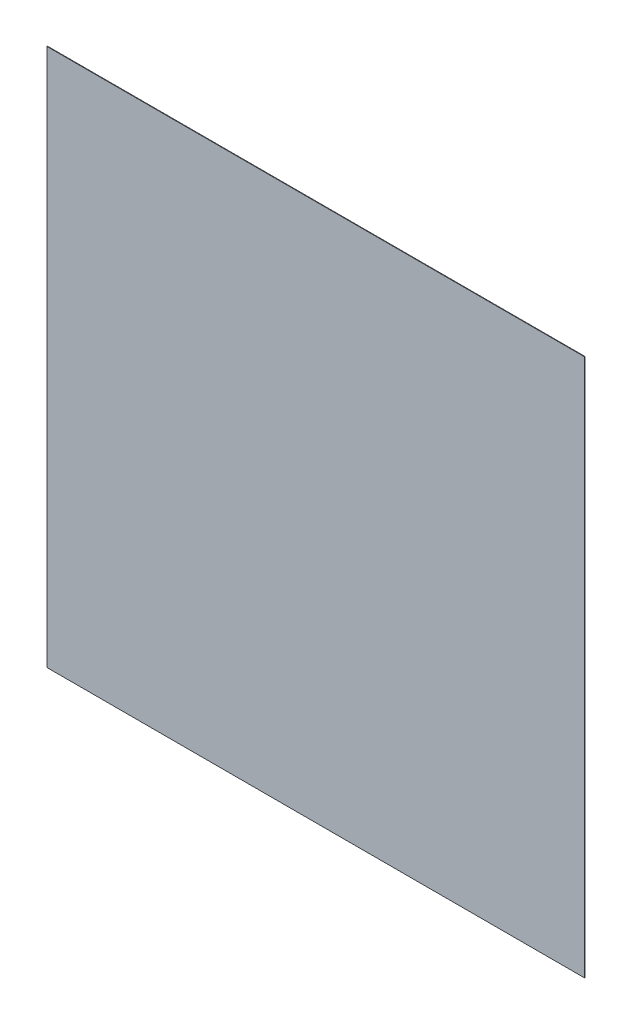
ISO-10303-21;
HEADER;
FILE_DESCRIPTION(('STEP AP214'),'2;1');
FILE_NAME('part.step','',(''),(''),'','','');
FILE_SCHEMA(('AUTOMOTIVE_DESIGN { 1 0 10303 214 1 1 1 1 }'));
ENDSEC;
DATA;
#1=APPLICATION_CONTEXT('core data for automotive mechanical design processes');
#2=APPLICATION_PROTOCOL_DEFINITION('international standard','automotive_design',2000,#1);
#3=PRODUCT_CONTEXT('',#1,'mechanical');
#4=PRODUCT('Part','Part','',(#3));
#5=PRODUCT_RELATED_PRODUCT_CATEGORY('part','',(#4));
#6=PRODUCT_DEFINITION_FORMATION('','',#4);
#7=PRODUCT_DEFINITION_CONTEXT('part definition',#1,'design');
#8=PRODUCT_DEFINITION('design','',#6,#7);
#9=PRODUCT_DEFINITION_SHAPE('','',#8);
#10=(LENGTH_UNIT() NAMED_UNIT(*) SI_UNIT(.MILLI.,.METRE.));
#11=(NAMED_UNIT(*) PLANE_ANGLE_UNIT() SI_UNIT($,.RADIAN.));
#12=(NAMED_UNIT(*) SI_UNIT($,.STERADIAN.) SOLID_ANGLE_UNIT());
#13=UNCERTAINTY_MEASURE_WITH_UNIT(LENGTH_MEASURE(1.E-05),#10,'distance_accuracy_value','');
#14=(GEOMETRIC_REPRESENTATION_CONTEXT(3) GLOBAL_UNCERTAINTY_ASSIGNED_CONTEXT((#13)) GLOBAL_UNIT_ASSIGNED_CONTEXT((#10,
#11,#12)) REPRESENTATION_CONTEXT('',''));
#15=CARTESIAN_POINT('',(0.,0.,0.));
#16=DIRECTION('',(0.,0.,1.));
#17=DIRECTION('',(1.,0.,0.));
#18=AXIS2_PLACEMENT_3D('',#15,#16,#17);
#19=CARTESIAN_POINT('',(-307.526886589295,151.392425827874,1.));
#20=DIRECTION('',(1.,0.,0.));
#21=DIRECTION('',(0.,1.,0.));
#22=AXIS2_PLACEMENT_3D('',#19,#20,#21);
#23=PLANE('',#22);
#24=DIRECTION('',(0.,-1.,0.));
#25=VECTOR('',#24,1.);
#26=CARTESIAN_POINT('',(-307.526886589295,151.392425827874,0.));
#27=LINE('',#26,#25);
#28=CARTESIAN_POINT('',(-307.526886589295,151.392425827874,0.));
#29=VERTEX_POINT('',#28);
#30=CARTESIAN_POINT('',(-307.526886589295,-848.607574172126,0.));
#31=VERTEX_POINT('',#30);
#32=EDGE_CURVE('E98',#29,#31,#27,.T.);
#33=ORIENTED_EDGE('',*,*,#32,.T.);
#34=DIRECTION('',(0.,0.,-1.));
#35=VECTOR('',#34,1.);
#36=CARTESIAN_POINT('',(-307.526886589295,-848.607574172126,1.));
#37=LINE('',#36,#35);
#38=CARTESIAN_POINT('',(-307.526886589295,-848.607574172126,1.));
#39=VERTEX_POINT('',#38);
#40=EDGE_CURVE('E11',#39,#31,#37,.T.);
#41=ORIENTED_EDGE('',*,*,#40,.F.);
#42=DIRECTION('',(0.,-1.,0.));
#43=VECTOR('',#42,1.);
#44=CARTESIAN_POINT('',(-307.526886589295,151.392425827874,1.));
#45=LINE('',#44,#43);
#46=CARTESIAN_POINT('',(-307.526886589295,151.392425827874,1.));
#47=VERTEX_POINT('',#46);
#48=EDGE_CURVE('E86',#47,#39,#45,.T.);
#49=ORIENTED_EDGE('',*,*,#48,.F.);
#50=DIRECTION('',(0.,0.,-1.));
#51=VECTOR('',#50,1.);
#52=CARTESIAN_POINT('',(-307.526886589295,151.392425827874,1.));
#53=LINE('',#52,#51);
#54=EDGE_CURVE('E94',#47,#29,#53,.T.);
#55=ORIENTED_EDGE('',*,*,#54,.T.);
#56=EDGE_LOOP('',(#33,#41,#49,#55));
#57=FACE_BOUND('',#56,.T.);
#58=ADVANCED_FACE('F35',(#57),#23,.F.);
#59=CARTESIAN_POINT('',(-307.526886589295,-848.607574172126,1.));
#60=DIRECTION('',(0.,1.,0.));
#61=DIRECTION('',(0.,0.,1.));
#62=AXIS2_PLACEMENT_3D('',#59,#60,#61);
#63=PLANE('',#62);
#64=DIRECTION('',(1.,0.,0.));
#65=VECTOR('',#64,1.);
#66=CARTESIAN_POINT('',(-307.526886589295,-848.607574172126,0.));
#67=LINE('',#66,#65);
#68=CARTESIAN_POINT('',(692.473113410706,-848.607574172126,0.));
#69=VERTEX_POINT('',#68);
#70=EDGE_CURVE('E90',#31,#69,#67,.T.);
#71=ORIENTED_EDGE('',*,*,#70,.T.);
#72=DIRECTION('',(0.,0.,-1.));
#73=VECTOR('',#72,1.);
#74=CARTESIAN_POINT('',(692.473113410706,-848.607574172126,1.));
#75=LINE('',#74,#73);
#76=CARTESIAN_POINT('',(692.473113410706,-848.607574172126,1.));
#77=VERTEX_POINT('',#76);
#78=EDGE_CURVE('E43',#77,#69,#75,.T.);
#79=ORIENTED_EDGE('',*,*,#78,.F.);
#80=DIRECTION('',(1.,0.,0.));
#81=VECTOR('',#80,1.);
#82=CARTESIAN_POINT('',(-307.526886589295,-848.607574172126,1.));
#83=LINE('',#82,#81);
#84=EDGE_CURVE('E81',#39,#77,#83,.T.);
#85=ORIENTED_EDGE('',*,*,#84,.F.);
#86=ORIENTED_EDGE('',*,*,#40,.T.);
#87=EDGE_LOOP('',(#71,#79,#85,#86));
#88=FACE_BOUND('',#87,.T.);
#89=ADVANCED_FACE('F89',(#88),#63,.F.);
#90=CARTESIAN_POINT('',(692.473113410705,151.392425827874,1.));
#91=DIRECTION('',(-1.,0.,0.));
#92=DIRECTION('',(0.,-1.,0.));
#93=AXIS2_PLACEMENT_3D('',#90,#91,#92);
#94=PLANE('',#93);
#95=DIRECTION('',(0.,1.,0.));
#96=VECTOR('',#95,1.);
#97=CARTESIAN_POINT('',(692.473113410705,151.392425827874,0.));
#98=LINE('',#97,#96);
#99=CARTESIAN_POINT('',(692.473113410705,151.392425827874,0.));
#100=VERTEX_POINT('',#99);
#101=EDGE_CURVE('E68',#69,#100,#98,.T.);
#102=ORIENTED_EDGE('',*,*,#101,.T.);
#103=DIRECTION('',(0.,0.,-1.));
#104=VECTOR('',#103,1.);
#105=CARTESIAN_POINT('',(692.473113410705,151.392425827874,1.));
#106=LINE('',#105,#104);
#107=CARTESIAN_POINT('',(692.473113410705,151.392425827874,1.));
#108=VERTEX_POINT('',#107);
#109=EDGE_CURVE('E91',#108,#100,#106,.T.);
#110=ORIENTED_EDGE('',*,*,#109,.F.);
#111=DIRECTION('',(0.,1.,0.));
#112=VECTOR('',#111,1.);
#113=CARTESIAN_POINT('',(692.473113410705,151.392425827874,1.));
#114=LINE('',#113,#112);
#115=EDGE_CURVE('E84',#77,#108,#114,.T.);
#116=ORIENTED_EDGE('',*,*,#115,.F.);
#117=ORIENTED_EDGE('',*,*,#78,.T.);
#118=EDGE_LOOP('',(#102,#110,#116,#117));
#119=FACE_BOUND('',#118,.T.);
#120=ADVANCED_FACE('F92',(#119),#94,.F.);
#121=CARTESIAN_POINT('',(-307.526886589295,151.392425827874,1.));
#122=DIRECTION('',(0.,-1.,0.));
#123=DIRECTION('',(0.,0.,-1.));
#124=AXIS2_PLACEMENT_3D('',#121,#122,#123);
#125=PLANE('',#124);
#126=DIRECTION('',(-1.,0.,0.));
#127=VECTOR('',#126,1.);
#128=CARTESIAN_POINT('',(-307.526886589295,151.392425827874,0.));
#129=LINE('',#128,#127);
#130=EDGE_CURVE('E74',#100,#29,#129,.T.);
#131=ORIENTED_EDGE('',*,*,#130,.T.);
#132=ORIENTED_EDGE('',*,*,#54,.F.);
#133=DIRECTION('',(-1.,0.,0.));
#134=VECTOR('',#133,1.);
#135=CARTESIAN_POINT('',(-307.526886589295,151.392425827874,1.));
#136=LINE('',#135,#134);
#137=EDGE_CURVE('E51',#108,#47,#136,.T.);
#138=ORIENTED_EDGE('',*,*,#137,.F.);
#139=ORIENTED_EDGE('',*,*,#109,.T.);
#140=EDGE_LOOP('',(#131,#132,#138,#139));
#141=FACE_BOUND('',#140,.T.);
#142=ADVANCED_FACE('F105',(#141),#125,.F.);
#143=CARTESIAN_POINT('',(0.,0.,1.));
#144=DIRECTION('',(0.,0.,1.));
#145=DIRECTION('',(1.,0.,0.));
#146=AXIS2_PLACEMENT_3D('',#143,#144,#145);
#147=PLANE('',#146);
#148=ORIENTED_EDGE('',*,*,#48,.T.);
#149=ORIENTED_EDGE('',*,*,#84,.T.);
#150=ORIENTED_EDGE('',*,*,#115,.T.);
#151=ORIENTED_EDGE('',*,*,#137,.T.);
#152=EDGE_LOOP('',(#148,#149,#150,#151));
#153=FACE_BOUND('',#152,.T.);
#154=ADVANCED_FACE('F82',(#153),#147,.T.);
#155=CARTESIAN_POINT('',(0.,0.,0.));
#156=DIRECTION('',(0.,0.,1.));
#157=DIRECTION('',(1.,0.,0.));
#158=AXIS2_PLACEMENT_3D('',#155,#156,#157);
#159=PLANE('',#158);
#160=ORIENTED_EDGE('',*,*,#32,.F.);
#161=ORIENTED_EDGE('',*,*,#130,.F.);
#162=ORIENTED_EDGE('',*,*,#101,.F.);
#163=ORIENTED_EDGE('',*,*,#70,.F.);
#164=EDGE_LOOP('',(#160,#161,#162,#163));
#165=FACE_BOUND('',#164,.T.);
#166=ADVANCED_FACE('F108',(#165),#159,.F.);
#167=CLOSED_SHELL('',(#58,#89,#120,#142,#154,#166));
#168=MANIFOLD_SOLID_BREP('B2',#167);
#169=ADVANCED_BREP_SHAPE_REPRESENTATION('',(#18,#168),#14);
#170=SHAPE_DEFINITION_REPRESENTATION(#9,#169);
ENDSEC;
END-ISO-10303-21;
